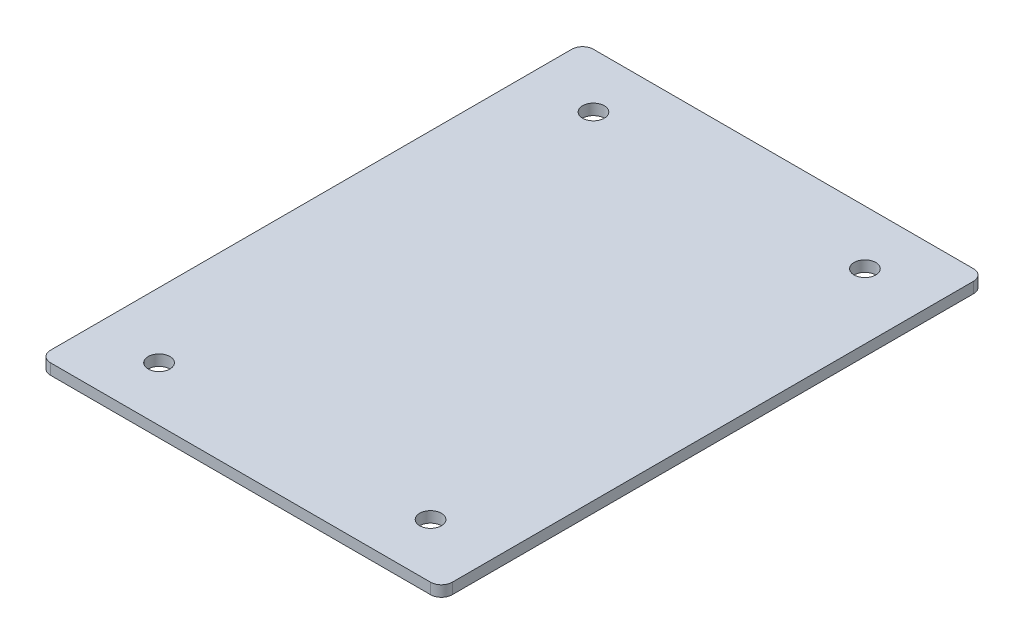
ISO-10303-21;
HEADER;
FILE_DESCRIPTION(('STEP AP214'),'2;1');
FILE_NAME('part.step','',(''),(''),'','','');
FILE_SCHEMA(('AUTOMOTIVE_DESIGN { 1 0 10303 214 1 1 1 1 }'));
ENDSEC;
DATA;
#1=APPLICATION_CONTEXT('core data for automotive mechanical design processes');
#2=APPLICATION_PROTOCOL_DEFINITION('international standard','automotive_design',2000,#1);
#3=PRODUCT_CONTEXT('',#1,'mechanical');
#4=PRODUCT('Part','Part','',(#3));
#5=PRODUCT_RELATED_PRODUCT_CATEGORY('part','',(#4));
#6=PRODUCT_DEFINITION_FORMATION('','',#4);
#7=PRODUCT_DEFINITION_CONTEXT('part definition',#1,'design');
#8=PRODUCT_DEFINITION('design','',#6,#7);
#9=PRODUCT_DEFINITION_SHAPE('','',#8);
#10=(LENGTH_UNIT() NAMED_UNIT(*) SI_UNIT(.MILLI.,.METRE.));
#11=(NAMED_UNIT(*) PLANE_ANGLE_UNIT() SI_UNIT($,.RADIAN.));
#12=(NAMED_UNIT(*) SI_UNIT($,.STERADIAN.) SOLID_ANGLE_UNIT());
#13=UNCERTAINTY_MEASURE_WITH_UNIT(LENGTH_MEASURE(1.E-05),#10,'distance_accuracy_value','');
#14=(GEOMETRIC_REPRESENTATION_CONTEXT(3) GLOBAL_UNCERTAINTY_ASSIGNED_CONTEXT((#13)) GLOBAL_UNIT_ASSIGNED_CONTEXT((#10,
#11,#12)) REPRESENTATION_CONTEXT('',''));
#15=CARTESIAN_POINT('',(0.,0.,0.));
#16=DIRECTION('',(0.,0.,1.));
#17=DIRECTION('',(1.,0.,0.));
#18=AXIS2_PLACEMENT_3D('',#15,#16,#17);
#19=CARTESIAN_POINT('',(0.,2.,0.));
#20=DIRECTION('',(1.,0.,0.));
#21=DIRECTION('',(0.,0.,-1.));
#22=AXIS2_PLACEMENT_3D('',#19,#20,#21);
#23=PLANE('',#22);
#24=DIRECTION('',(0.,0.,1.));
#25=VECTOR('',#24,1.);
#26=CARTESIAN_POINT('',(0.,2.,0.));
#27=LINE('',#26,#25);
#28=CARTESIAN_POINT('',(0.,2.,-98.));
#29=VERTEX_POINT('',#28);
#30=CARTESIAN_POINT('',(0.,2.,-2.));
#31=VERTEX_POINT('',#30);
#32=EDGE_CURVE('E126',#29,#31,#27,.T.);
#33=ORIENTED_EDGE('',*,*,#32,.F.);
#34=DIRECTION('',(0.,-1.,0.));
#35=VECTOR('',#34,1.);
#36=CARTESIAN_POINT('',(0.,2.,-98.));
#37=LINE('',#36,#35);
#38=CARTESIAN_POINT('',(0.,0.,-98.));
#39=VERTEX_POINT('',#38);
#40=EDGE_CURVE('E111',#29,#39,#37,.T.);
#41=ORIENTED_EDGE('',*,*,#40,.T.);
#42=DIRECTION('',(0.,0.,1.));
#43=VECTOR('',#42,1.);
#44=CARTESIAN_POINT('',(0.,0.,0.));
#45=LINE('',#44,#43);
#46=CARTESIAN_POINT('',(0.,0.,-2.));
#47=VERTEX_POINT('',#46);
#48=EDGE_CURVE('E123',#39,#47,#45,.T.);
#49=ORIENTED_EDGE('',*,*,#48,.T.);
#50=DIRECTION('',(0.,-1.,0.));
#51=VECTOR('',#50,1.);
#52=CARTESIAN_POINT('',(0.,2.,-2.));
#53=LINE('',#52,#51);
#54=EDGE_CURVE('E128',#47,#31,#53,.F.);
#55=ORIENTED_EDGE('',*,*,#54,.T.);
#56=EDGE_LOOP('',(#33,#41,#49,#55));
#57=FACE_BOUND('',#56,.T.);
#58=ADVANCED_FACE('F36',(#57),#23,.F.);
#59=CARTESIAN_POINT('',(0.,2.,0.));
#60=DIRECTION('',(0.,0.,-1.));
#61=DIRECTION('',(-1.,0.,0.));
#62=AXIS2_PLACEMENT_3D('',#59,#60,#61);
#63=PLANE('',#62);
#64=DIRECTION('',(1.,0.,0.));
#65=VECTOR('',#64,1.);
#66=CARTESIAN_POINT('',(0.,2.,0.));
#67=LINE('',#66,#65);
#68=CARTESIAN_POINT('',(2.,2.,0.));
#69=VERTEX_POINT('',#68);
#70=CARTESIAN_POINT('',(72.,2.,0.));
#71=VERTEX_POINT('',#70);
#72=EDGE_CURVE('E176',#69,#71,#67,.T.);
#73=ORIENTED_EDGE('',*,*,#72,.F.);
#74=DIRECTION('',(0.,-1.,0.));
#75=VECTOR('',#74,1.);
#76=CARTESIAN_POINT('',(2.,2.,0.));
#77=LINE('',#76,#75);
#78=CARTESIAN_POINT('',(2.,0.,0.));
#79=VERTEX_POINT('',#78);
#80=EDGE_CURVE('E11',#69,#79,#77,.T.);
#81=ORIENTED_EDGE('',*,*,#80,.T.);
#82=DIRECTION('',(1.,0.,0.));
#83=VECTOR('',#82,1.);
#84=CARTESIAN_POINT('',(0.,0.,0.));
#85=LINE('',#84,#83);
#86=CARTESIAN_POINT('',(72.,0.,0.));
#87=VERTEX_POINT('',#86);
#88=EDGE_CURVE('E133',#79,#87,#85,.T.);
#89=ORIENTED_EDGE('',*,*,#88,.T.);
#90=DIRECTION('',(0.,-1.,0.));
#91=VECTOR('',#90,1.);
#92=CARTESIAN_POINT('',(72.,2.,0.));
#93=LINE('',#92,#91);
#94=EDGE_CURVE('E44',#87,#71,#93,.F.);
#95=ORIENTED_EDGE('',*,*,#94,.T.);
#96=EDGE_LOOP('',(#73,#81,#89,#95));
#97=FACE_BOUND('',#96,.T.);
#98=ADVANCED_FACE('F175',(#97),#63,.F.);
#99=CARTESIAN_POINT('',(74.,2.,0.));
#100=DIRECTION('',(-1.,0.,0.));
#101=DIRECTION('',(0.,0.,1.));
#102=AXIS2_PLACEMENT_3D('',#99,#100,#101);
#103=PLANE('',#102);
#104=DIRECTION('',(0.,0.,-1.));
#105=VECTOR('',#104,1.);
#106=CARTESIAN_POINT('',(74.,0.,0.));
#107=LINE('',#106,#105);
#108=CARTESIAN_POINT('',(74.,0.,-2.));
#109=VERTEX_POINT('',#108);
#110=CARTESIAN_POINT('',(74.,0.,-98.));
#111=VERTEX_POINT('',#110);
#112=EDGE_CURVE('E137',#109,#111,#107,.T.);
#113=ORIENTED_EDGE('',*,*,#112,.T.);
#114=DIRECTION('',(0.,-1.,0.));
#115=VECTOR('',#114,1.);
#116=CARTESIAN_POINT('',(74.,2.,-98.));
#117=LINE('',#116,#115);
#118=CARTESIAN_POINT('',(74.,2.,-98.));
#119=VERTEX_POINT('',#118);
#120=EDGE_CURVE('E53',#111,#119,#117,.F.);
#121=ORIENTED_EDGE('',*,*,#120,.T.);
#122=DIRECTION('',(0.,0.,-1.));
#123=VECTOR('',#122,1.);
#124=CARTESIAN_POINT('',(74.,2.,0.));
#125=LINE('',#124,#123);
#126=CARTESIAN_POINT('',(74.,2.,-2.));
#127=VERTEX_POINT('',#126);
#128=EDGE_CURVE('E182',#127,#119,#125,.T.);
#129=ORIENTED_EDGE('',*,*,#128,.F.);
#130=DIRECTION('',(0.,-1.,0.));
#131=VECTOR('',#130,1.);
#132=CARTESIAN_POINT('',(74.,2.,-2.));
#133=LINE('',#132,#131);
#134=EDGE_CURVE('E168',#127,#109,#133,.T.);
#135=ORIENTED_EDGE('',*,*,#134,.T.);
#136=EDGE_LOOP('',(#113,#121,#129,#135));
#137=FACE_BOUND('',#136,.T.);
#138=ADVANCED_FACE('F186',(#137),#103,.F.);
#139=CARTESIAN_POINT('',(0.,2.,-100.));
#140=DIRECTION('',(0.,0.,1.));
#141=DIRECTION('',(1.,0.,0.));
#142=AXIS2_PLACEMENT_3D('',#139,#140,#141);
#143=PLANE('',#142);
#144=DIRECTION('',(-1.,0.,0.));
#145=VECTOR('',#144,1.);
#146=CARTESIAN_POINT('',(0.,0.,-100.));
#147=LINE('',#146,#145);
#148=CARTESIAN_POINT('',(72.,0.,-100.));
#149=VERTEX_POINT('',#148);
#150=CARTESIAN_POINT('',(2.,0.,-100.));
#151=VERTEX_POINT('',#150);
#152=EDGE_CURVE('E148',#149,#151,#147,.T.);
#153=ORIENTED_EDGE('',*,*,#152,.T.);
#154=DIRECTION('',(0.,-1.,0.));
#155=VECTOR('',#154,1.);
#156=CARTESIAN_POINT('',(2.,2.,-100.));
#157=LINE('',#156,#155);
#158=CARTESIAN_POINT('',(2.,2.,-100.));
#159=VERTEX_POINT('',#158);
#160=EDGE_CURVE('E112',#151,#159,#157,.F.);
#161=ORIENTED_EDGE('',*,*,#160,.T.);
#162=DIRECTION('',(-1.,0.,0.));
#163=VECTOR('',#162,1.);
#164=CARTESIAN_POINT('',(0.,2.,-100.));
#165=LINE('',#164,#163);
#166=CARTESIAN_POINT('',(72.,2.,-100.));
#167=VERTEX_POINT('',#166);
#168=EDGE_CURVE('E143',#167,#159,#165,.T.);
#169=ORIENTED_EDGE('',*,*,#168,.F.);
#170=DIRECTION('',(0.,-1.,0.));
#171=VECTOR('',#170,1.);
#172=CARTESIAN_POINT('',(72.,2.,-100.));
#173=LINE('',#172,#171);
#174=EDGE_CURVE('E117',#167,#149,#173,.T.);
#175=ORIENTED_EDGE('',*,*,#174,.T.);
#176=EDGE_LOOP('',(#153,#161,#169,#175));
#177=FACE_BOUND('',#176,.T.);
#178=ADVANCED_FACE('F193',(#177),#143,.F.);
#179=CARTESIAN_POINT('',(0.,2.,-100.));
#180=DIRECTION('',(0.,-1.,0.));
#181=DIRECTION('',(0.,0.,-1.));
#182=AXIS2_PLACEMENT_3D('',#179,#180,#181);
#183=PLANE('',#182);
#184=CARTESIAN_POINT('',(12.,2.,-10.));
#185=DIRECTION('',(0.,1.,0.));
#186=DIRECTION('',(0.,0.,1.));
#187=AXIS2_PLACEMENT_3D('',#184,#185,#186);
#188=CIRCLE('',#187,2.);
#189=CARTESIAN_POINT('',(12.,2.,-8.));
#190=VERTEX_POINT('',#189);
#191=EDGE_CURVE('E213',#190,#190,#188,.T.);
#192=ORIENTED_EDGE('',*,*,#191,.F.);
#193=EDGE_LOOP('',(#192));
#194=FACE_BOUND('',#193,.T.);
#195=CARTESIAN_POINT('',(62.,2.,-10.));
#196=DIRECTION('',(0.,1.,0.));
#197=DIRECTION('',(0.,0.,1.));
#198=AXIS2_PLACEMENT_3D('',#195,#196,#197);
#199=CIRCLE('',#198,1.99999999999999);
#200=CARTESIAN_POINT('',(62.,2.,-8.00000000000001));
#201=VERTEX_POINT('',#200);
#202=EDGE_CURVE('E207',#201,#201,#199,.T.);
#203=ORIENTED_EDGE('',*,*,#202,.F.);
#204=EDGE_LOOP('',(#203));
#205=FACE_BOUND('',#204,.T.);
#206=CARTESIAN_POINT('',(62.,2.,-90.));
#207=DIRECTION('',(0.,1.,0.));
#208=DIRECTION('',(0.,0.,1.));
#209=AXIS2_PLACEMENT_3D('',#206,#207,#208);
#210=CIRCLE('',#209,1.99999999999999);
#211=CARTESIAN_POINT('',(62.,2.,-88.));
#212=VERTEX_POINT('',#211);
#213=EDGE_CURVE('E201',#212,#212,#210,.T.);
#214=ORIENTED_EDGE('',*,*,#213,.F.);
#215=EDGE_LOOP('',(#214));
#216=FACE_BOUND('',#215,.T.);
#217=CARTESIAN_POINT('',(12.,2.,-90.));
#218=DIRECTION('',(0.,1.,0.));
#219=DIRECTION('',(0.,0.,1.));
#220=AXIS2_PLACEMENT_3D('',#217,#218,#219);
#221=CIRCLE('',#220,2.);
#222=CARTESIAN_POINT('',(12.,2.,-88.));
#223=VERTEX_POINT('',#222);
#224=EDGE_CURVE('E140',#223,#223,#221,.T.);
#225=ORIENTED_EDGE('',*,*,#224,.F.);
#226=EDGE_LOOP('',(#225));
#227=FACE_BOUND('',#226,.T.);
#228=ORIENTED_EDGE('',*,*,#168,.T.);
#229=CARTESIAN_POINT('',(2.,2.,-98.));
#230=DIRECTION('',(0.,-1.,0.));
#231=DIRECTION('',(0.,0.,-1.));
#232=AXIS2_PLACEMENT_3D('',#229,#230,#231);
#233=CIRCLE('',#232,2.);
#234=EDGE_CURVE('E166',#159,#29,#233,.F.);
#235=ORIENTED_EDGE('',*,*,#234,.T.);
#236=ORIENTED_EDGE('',*,*,#32,.T.);
#237=CARTESIAN_POINT('',(2.,2.,-2.));
#238=DIRECTION('',(0.,-1.,0.));
#239=DIRECTION('',(0.,0.,-1.));
#240=AXIS2_PLACEMENT_3D('',#237,#238,#239);
#241=CIRCLE('',#240,2.);
#242=EDGE_CURVE('E161',#31,#69,#241,.F.);
#243=ORIENTED_EDGE('',*,*,#242,.T.);
#244=ORIENTED_EDGE('',*,*,#72,.T.);
#245=CARTESIAN_POINT('',(72.,2.,-2.));
#246=DIRECTION('',(0.,-1.,0.));
#247=DIRECTION('',(0.,0.,-1.));
#248=AXIS2_PLACEMENT_3D('',#245,#246,#247);
#249=CIRCLE('',#248,2.);
#250=EDGE_CURVE('E60',#71,#127,#249,.F.);
#251=ORIENTED_EDGE('',*,*,#250,.T.);
#252=ORIENTED_EDGE('',*,*,#128,.T.);
#253=CARTESIAN_POINT('',(72.,2.,-98.));
#254=DIRECTION('',(0.,-1.,0.));
#255=DIRECTION('',(0.,0.,-1.));
#256=AXIS2_PLACEMENT_3D('',#253,#254,#255);
#257=CIRCLE('',#256,2.);
#258=EDGE_CURVE('E163',#119,#167,#257,.F.);
#259=ORIENTED_EDGE('',*,*,#258,.T.);
#260=EDGE_LOOP('',(#228,#235,#236,#243,#244,#251,#252,#259));
#261=FACE_BOUND('',#260,.T.);
#262=ADVANCED_FACE('F180',(#194,#205,#216,#227,#261),#183,.F.);
#263=CARTESIAN_POINT('',(0.,0.,-100.));
#264=DIRECTION('',(0.,-1.,0.));
#265=DIRECTION('',(0.,0.,-1.));
#266=AXIS2_PLACEMENT_3D('',#263,#264,#265);
#267=PLANE('',#266);
#268=CARTESIAN_POINT('',(12.,0.,-10.));
#269=DIRECTION('',(0.,1.,0.));
#270=DIRECTION('',(0.,0.,1.));
#271=AXIS2_PLACEMENT_3D('',#268,#269,#270);
#272=CIRCLE('',#271,2.);
#273=CARTESIAN_POINT('',(12.,0.,-8.));
#274=VERTEX_POINT('',#273);
#275=EDGE_CURVE('E210',#274,#274,#272,.T.);
#276=ORIENTED_EDGE('',*,*,#275,.T.);
#277=EDGE_LOOP('',(#276));
#278=FACE_BOUND('',#277,.T.);
#279=CARTESIAN_POINT('',(62.,0.,-10.));
#280=DIRECTION('',(0.,1.,0.));
#281=DIRECTION('',(0.,0.,1.));
#282=AXIS2_PLACEMENT_3D('',#279,#280,#281);
#283=CIRCLE('',#282,1.99999999999999);
#284=CARTESIAN_POINT('',(62.,0.,-8.00000000000001));
#285=VERTEX_POINT('',#284);
#286=EDGE_CURVE('E204',#285,#285,#283,.T.);
#287=ORIENTED_EDGE('',*,*,#286,.T.);
#288=EDGE_LOOP('',(#287));
#289=FACE_BOUND('',#288,.T.);
#290=CARTESIAN_POINT('',(62.,0.,-90.));
#291=DIRECTION('',(0.,1.,0.));
#292=DIRECTION('',(0.,0.,1.));
#293=AXIS2_PLACEMENT_3D('',#290,#291,#292);
#294=CIRCLE('',#293,1.99999999999999);
#295=CARTESIAN_POINT('',(62.,0.,-88.));
#296=VERTEX_POINT('',#295);
#297=EDGE_CURVE('E199',#296,#296,#294,.T.);
#298=ORIENTED_EDGE('',*,*,#297,.T.);
#299=EDGE_LOOP('',(#298));
#300=FACE_BOUND('',#299,.T.);
#301=CARTESIAN_POINT('',(12.,0.,-90.));
#302=DIRECTION('',(0.,1.,0.));
#303=DIRECTION('',(0.,0.,1.));
#304=AXIS2_PLACEMENT_3D('',#301,#302,#303);
#305=CIRCLE('',#304,2.);
#306=CARTESIAN_POINT('',(12.,0.,-88.));
#307=VERTEX_POINT('',#306);
#308=EDGE_CURVE('E134',#307,#307,#305,.T.);
#309=ORIENTED_EDGE('',*,*,#308,.T.);
#310=EDGE_LOOP('',(#309));
#311=FACE_BOUND('',#310,.T.);
#312=ORIENTED_EDGE('',*,*,#48,.F.);
#313=CARTESIAN_POINT('',(2.,0.,-98.));
#314=DIRECTION('',(0.,-1.,0.));
#315=DIRECTION('',(0.,0.,-1.));
#316=AXIS2_PLACEMENT_3D('',#313,#314,#315);
#317=CIRCLE('',#316,2.);
#318=EDGE_CURVE('E107',#39,#151,#317,.T.);
#319=ORIENTED_EDGE('',*,*,#318,.T.);
#320=ORIENTED_EDGE('',*,*,#152,.F.);
#321=CARTESIAN_POINT('',(72.,0.,-98.));
#322=DIRECTION('',(0.,-1.,0.));
#323=DIRECTION('',(0.,0.,-1.));
#324=AXIS2_PLACEMENT_3D('',#321,#322,#323);
#325=CIRCLE('',#324,2.);
#326=EDGE_CURVE('E118',#149,#111,#325,.T.);
#327=ORIENTED_EDGE('',*,*,#326,.T.);
#328=ORIENTED_EDGE('',*,*,#112,.F.);
#329=CARTESIAN_POINT('',(72.,0.,-2.));
#330=DIRECTION('',(0.,-1.,0.));
#331=DIRECTION('',(0.,0.,-1.));
#332=AXIS2_PLACEMENT_3D('',#329,#330,#331);
#333=CIRCLE('',#332,2.);
#334=EDGE_CURVE('E127',#109,#87,#333,.T.);
#335=ORIENTED_EDGE('',*,*,#334,.T.);
#336=ORIENTED_EDGE('',*,*,#88,.F.);
#337=CARTESIAN_POINT('',(2.,0.,-2.));
#338=DIRECTION('',(0.,-1.,0.));
#339=DIRECTION('',(0.,0.,-1.));
#340=AXIS2_PLACEMENT_3D('',#337,#338,#339);
#341=CIRCLE('',#340,2.);
#342=EDGE_CURVE('E132',#79,#47,#341,.T.);
#343=ORIENTED_EDGE('',*,*,#342,.T.);
#344=EDGE_LOOP('',(#312,#319,#320,#327,#328,#335,#336,#343));
#345=FACE_BOUND('',#344,.T.);
#346=ADVANCED_FACE('F130',(#278,#289,#300,#311,#345),#267,.T.);
#347=CARTESIAN_POINT('',(2.,2.,-98.));
#348=DIRECTION('',(0.,-1.,0.));
#349=DIRECTION('',(0.,0.,-1.));
#350=AXIS2_PLACEMENT_3D('',#347,#348,#349);
#351=CYLINDRICAL_SURFACE('',#350,2.);
#352=ORIENTED_EDGE('',*,*,#234,.F.);
#353=ORIENTED_EDGE('',*,*,#160,.F.);
#354=ORIENTED_EDGE('',*,*,#318,.F.);
#355=ORIENTED_EDGE('',*,*,#40,.F.);
#356=EDGE_LOOP('',(#352,#353,#354,#355));
#357=FACE_BOUND('',#356,.T.);
#358=ADVANCED_FACE('F110',(#357),#351,.T.);
#359=CARTESIAN_POINT('',(72.,2.,-98.));
#360=DIRECTION('',(0.,-1.,0.));
#361=DIRECTION('',(0.,0.,-1.));
#362=AXIS2_PLACEMENT_3D('',#359,#360,#361);
#363=CYLINDRICAL_SURFACE('',#362,2.);
#364=ORIENTED_EDGE('',*,*,#258,.F.);
#365=ORIENTED_EDGE('',*,*,#120,.F.);
#366=ORIENTED_EDGE('',*,*,#326,.F.);
#367=ORIENTED_EDGE('',*,*,#174,.F.);
#368=EDGE_LOOP('',(#364,#365,#366,#367));
#369=FACE_BOUND('',#368,.T.);
#370=ADVANCED_FACE('F190',(#369),#363,.T.);
#371=CARTESIAN_POINT('',(2.,2.,-2.));
#372=DIRECTION('',(0.,-1.,0.));
#373=DIRECTION('',(0.,0.,-1.));
#374=AXIS2_PLACEMENT_3D('',#371,#372,#373);
#375=CYLINDRICAL_SURFACE('',#374,2.);
#376=ORIENTED_EDGE('',*,*,#242,.F.);
#377=ORIENTED_EDGE('',*,*,#54,.F.);
#378=ORIENTED_EDGE('',*,*,#342,.F.);
#379=ORIENTED_EDGE('',*,*,#80,.F.);
#380=EDGE_LOOP('',(#376,#377,#378,#379));
#381=FACE_BOUND('',#380,.T.);
#382=ADVANCED_FACE('F248',(#381),#375,.T.);
#383=CARTESIAN_POINT('',(72.,2.,-2.));
#384=DIRECTION('',(0.,-1.,0.));
#385=DIRECTION('',(0.,0.,-1.));
#386=AXIS2_PLACEMENT_3D('',#383,#384,#385);
#387=CYLINDRICAL_SURFACE('',#386,2.);
#388=ORIENTED_EDGE('',*,*,#250,.F.);
#389=ORIENTED_EDGE('',*,*,#94,.F.);
#390=ORIENTED_EDGE('',*,*,#334,.F.);
#391=ORIENTED_EDGE('',*,*,#134,.F.);
#392=EDGE_LOOP('',(#388,#389,#390,#391));
#393=FACE_BOUND('',#392,.T.);
#394=ADVANCED_FACE('F38',(#393),#387,.T.);
#395=CARTESIAN_POINT('',(12.,0.,-90.));
#396=DIRECTION('',(0.,1.,0.));
#397=DIRECTION('',(0.,0.,1.));
#398=AXIS2_PLACEMENT_3D('',#395,#396,#397);
#399=CYLINDRICAL_SURFACE('',#398,2.);
#400=ORIENTED_EDGE('',*,*,#308,.F.);
#401=EDGE_LOOP('',(#400));
#402=FACE_BOUND('',#401,.T.);
#403=ORIENTED_EDGE('',*,*,#224,.T.);
#404=EDGE_LOOP('',(#403));
#405=FACE_BOUND('',#404,.T.);
#406=ADVANCED_FACE('F237',(#402,#405),#399,.F.);
#407=CARTESIAN_POINT('',(62.,0.,-90.));
#408=DIRECTION('',(0.,1.,0.));
#409=DIRECTION('',(0.,0.,1.));
#410=AXIS2_PLACEMENT_3D('',#407,#408,#409);
#411=CYLINDRICAL_SURFACE('',#410,1.99999999999999);
#412=ORIENTED_EDGE('',*,*,#297,.F.);
#413=EDGE_LOOP('',(#412));
#414=FACE_BOUND('',#413,.T.);
#415=ORIENTED_EDGE('',*,*,#213,.T.);
#416=EDGE_LOOP('',(#415));
#417=FACE_BOUND('',#416,.T.);
#418=ADVANCED_FACE('F239',(#414,#417),#411,.F.);
#419=CARTESIAN_POINT('',(62.,0.,-10.));
#420=DIRECTION('',(0.,1.,0.));
#421=DIRECTION('',(0.,0.,1.));
#422=AXIS2_PLACEMENT_3D('',#419,#420,#421);
#423=CYLINDRICAL_SURFACE('',#422,1.99999999999999);
#424=ORIENTED_EDGE('',*,*,#286,.F.);
#425=EDGE_LOOP('',(#424));
#426=FACE_BOUND('',#425,.T.);
#427=ORIENTED_EDGE('',*,*,#202,.T.);
#428=EDGE_LOOP('',(#427));
#429=FACE_BOUND('',#428,.T.);
#430=ADVANCED_FACE('F224',(#426,#429),#423,.F.);
#431=CARTESIAN_POINT('',(12.,0.,-10.));
#432=DIRECTION('',(0.,1.,0.));
#433=DIRECTION('',(0.,0.,1.));
#434=AXIS2_PLACEMENT_3D('',#431,#432,#433);
#435=CYLINDRICAL_SURFACE('',#434,2.);
#436=ORIENTED_EDGE('',*,*,#275,.F.);
#437=EDGE_LOOP('',(#436));
#438=FACE_BOUND('',#437,.T.);
#439=ORIENTED_EDGE('',*,*,#191,.T.);
#440=EDGE_LOOP('',(#439));
#441=FACE_BOUND('',#440,.T.);
#442=ADVANCED_FACE('F221',(#438,#441),#435,.F.);
#443=CLOSED_SHELL('',(#58,#98,#138,#178,#262,#346,#358,#370,#382,#394,#406,#418,#430,#442));
#444=MANIFOLD_SOLID_BREP('B2',#443);
#445=ADVANCED_BREP_SHAPE_REPRESENTATION('',(#18,#444),#14);
#446=SHAPE_DEFINITION_REPRESENTATION(#9,#445);
ENDSEC;
END-ISO-10303-21;
